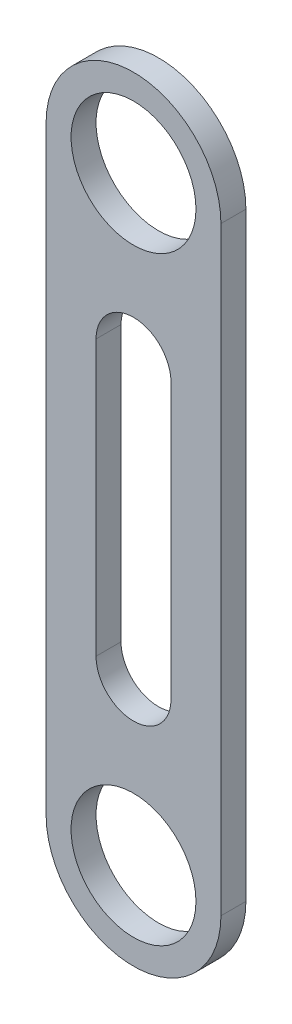
ISO-10303-21;
HEADER;
FILE_DESCRIPTION(('STEP AP214'),'2;1');
FILE_NAME('part.step','',(''),(''),'','','');
FILE_SCHEMA(('AUTOMOTIVE_DESIGN { 1 0 10303 214 1 1 1 1 }'));
ENDSEC;
DATA;
#1=APPLICATION_CONTEXT('core data for automotive mechanical design processes');
#2=APPLICATION_PROTOCOL_DEFINITION('international standard','automotive_design',2000,#1);
#3=PRODUCT_CONTEXT('',#1,'mechanical');
#4=PRODUCT('Part','Part','',(#3));
#5=PRODUCT_RELATED_PRODUCT_CATEGORY('part','',(#4));
#6=PRODUCT_DEFINITION_FORMATION('','',#4);
#7=PRODUCT_DEFINITION_CONTEXT('part definition',#1,'design');
#8=PRODUCT_DEFINITION('design','',#6,#7);
#9=PRODUCT_DEFINITION_SHAPE('','',#8);
#10=(LENGTH_UNIT() NAMED_UNIT(*) SI_UNIT(.MILLI.,.METRE.));
#11=(NAMED_UNIT(*) PLANE_ANGLE_UNIT() SI_UNIT($,.RADIAN.));
#12=(NAMED_UNIT(*) SI_UNIT($,.STERADIAN.) SOLID_ANGLE_UNIT());
#13=UNCERTAINTY_MEASURE_WITH_UNIT(LENGTH_MEASURE(1.E-05),#10,'distance_accuracy_value','');
#14=(GEOMETRIC_REPRESENTATION_CONTEXT(3) GLOBAL_UNCERTAINTY_ASSIGNED_CONTEXT((#13)) GLOBAL_UNIT_ASSIGNED_CONTEXT((#10,
#11,#12)) REPRESENTATION_CONTEXT('',''));
#15=CARTESIAN_POINT('',(0.,0.,0.));
#16=DIRECTION('',(0.,0.,1.));
#17=DIRECTION('',(1.,0.,0.));
#18=AXIS2_PLACEMENT_3D('',#15,#16,#17);
#19=CARTESIAN_POINT('',(4.76250000000001,0.,3.175));
#20=DIRECTION('',(-1.,0.,0.));
#21=DIRECTION('',(0.,-1.,0.));
#22=AXIS2_PLACEMENT_3D('',#19,#20,#21);
#23=PLANE('',#22);
#24=DIRECTION('',(0.,1.,0.));
#25=VECTOR('',#24,1.);
#26=CARTESIAN_POINT('',(4.76250000000001,0.,0.));
#27=LINE('',#26,#25);
#28=CARTESIAN_POINT('',(4.76250000000001,20.6375,0.));
#29=VERTEX_POINT('',#28);
#30=CARTESIAN_POINT('',(4.76250000000001,55.5625,0.));
#31=VERTEX_POINT('',#30);
#32=EDGE_CURVE('E188',#29,#31,#27,.T.);
#33=ORIENTED_EDGE('',*,*,#32,.F.);
#34=DIRECTION('',(0.,0.,-1.));
#35=VECTOR('',#34,1.);
#36=CARTESIAN_POINT('',(4.76250000000001,20.6375,3.175));
#37=LINE('',#36,#35);
#38=CARTESIAN_POINT('',(4.76250000000001,20.6375,3.175));
#39=VERTEX_POINT('',#38);
#40=EDGE_CURVE('E118',#39,#29,#37,.T.);
#41=ORIENTED_EDGE('',*,*,#40,.F.);
#42=DIRECTION('',(0.,1.,0.));
#43=VECTOR('',#42,1.);
#44=CARTESIAN_POINT('',(4.76250000000001,0.,3.175));
#45=LINE('',#44,#43);
#46=CARTESIAN_POINT('',(4.76250000000001,55.5625,3.175));
#47=VERTEX_POINT('',#46);
#48=EDGE_CURVE('E186',#39,#47,#45,.T.);
#49=ORIENTED_EDGE('',*,*,#48,.T.);
#50=DIRECTION('',(0.,0.,-1.));
#51=VECTOR('',#50,1.);
#52=CARTESIAN_POINT('',(4.76250000000001,55.5625,3.175));
#53=LINE('',#52,#51);
#54=EDGE_CURVE('E12',#47,#31,#53,.T.);
#55=ORIENTED_EDGE('',*,*,#54,.T.);
#56=EDGE_LOOP('',(#33,#41,#49,#55));
#57=FACE_BOUND('',#56,.T.);
#58=ADVANCED_FACE('F108',(#57),#23,.T.);
#59=CARTESIAN_POINT('',(0.,20.6375,3.175));
#60=DIRECTION('',(0.,0.,-1.));
#61=DIRECTION('',(-1.,0.,0.));
#62=AXIS2_PLACEMENT_3D('',#59,#60,#61);
#63=CYLINDRICAL_SURFACE('',#62,4.7625);
#64=CARTESIAN_POINT('',(0.,20.6375,0.));
#65=DIRECTION('',(0.,0.,1.));
#66=DIRECTION('',(1.,0.,0.));
#67=AXIS2_PLACEMENT_3D('',#64,#65,#66);
#68=CIRCLE('',#67,4.7625);
#69=CARTESIAN_POINT('',(-4.76249999999999,20.6375,0.));
#70=VERTEX_POINT('',#69);
#71=EDGE_CURVE('E216',#70,#29,#68,.T.);
#72=ORIENTED_EDGE('',*,*,#71,.F.);
#73=DIRECTION('',(0.,0.,-1.));
#74=VECTOR('',#73,1.);
#75=CARTESIAN_POINT('',(-4.76249999999999,20.6375,3.175));
#76=LINE('',#75,#74);
#77=CARTESIAN_POINT('',(-4.76249999999999,20.6375,3.175));
#78=VERTEX_POINT('',#77);
#79=EDGE_CURVE('E154',#78,#70,#76,.T.);
#80=ORIENTED_EDGE('',*,*,#79,.F.);
#81=CARTESIAN_POINT('',(0.,20.6375,3.175));
#82=DIRECTION('',(0.,0.,1.));
#83=DIRECTION('',(1.,0.,0.));
#84=AXIS2_PLACEMENT_3D('',#81,#82,#83);
#85=CIRCLE('',#84,4.7625);
#86=EDGE_CURVE('E196',#78,#39,#85,.T.);
#87=ORIENTED_EDGE('',*,*,#86,.T.);
#88=ORIENTED_EDGE('',*,*,#40,.T.);
#89=EDGE_LOOP('',(#72,#80,#87,#88));
#90=FACE_BOUND('',#89,.T.);
#91=ADVANCED_FACE('F199',(#90),#63,.F.);
#92=CARTESIAN_POINT('',(-4.7625,0.,3.175));
#93=DIRECTION('',(-1.,0.,0.));
#94=DIRECTION('',(0.,-1.,0.));
#95=AXIS2_PLACEMENT_3D('',#92,#93,#94);
#96=PLANE('',#95);
#97=DIRECTION('',(0.,1.,0.));
#98=VECTOR('',#97,1.);
#99=CARTESIAN_POINT('',(-4.7625,0.,0.));
#100=LINE('',#99,#98);
#101=CARTESIAN_POINT('',(-4.76249999999999,55.5625,0.));
#102=VERTEX_POINT('',#101);
#103=EDGE_CURVE('E218',#70,#102,#100,.T.);
#104=ORIENTED_EDGE('',*,*,#103,.T.);
#105=DIRECTION('',(0.,0.,-1.));
#106=VECTOR('',#105,1.);
#107=CARTESIAN_POINT('',(-4.76249999999999,55.5625,3.175));
#108=LINE('',#107,#106);
#109=CARTESIAN_POINT('',(-4.76249999999999,55.5625,3.175));
#110=VERTEX_POINT('',#109);
#111=EDGE_CURVE('E161',#110,#102,#108,.T.);
#112=ORIENTED_EDGE('',*,*,#111,.F.);
#113=DIRECTION('',(0.,1.,0.));
#114=VECTOR('',#113,1.);
#115=CARTESIAN_POINT('',(-4.7625,0.,3.175));
#116=LINE('',#115,#114);
#117=EDGE_CURVE('E127',#78,#110,#116,.T.);
#118=ORIENTED_EDGE('',*,*,#117,.F.);
#119=ORIENTED_EDGE('',*,*,#79,.T.);
#120=EDGE_LOOP('',(#104,#112,#118,#119));
#121=FACE_BOUND('',#120,.T.);
#122=ADVANCED_FACE('F284',(#121),#96,.F.);
#123=CARTESIAN_POINT('',(0.,55.5625,3.175));
#124=DIRECTION('',(0.,0.,-1.));
#125=DIRECTION('',(-1.,0.,0.));
#126=AXIS2_PLACEMENT_3D('',#123,#124,#125);
#127=CYLINDRICAL_SURFACE('',#126,4.7625);
#128=CARTESIAN_POINT('',(0.,55.5625,0.));
#129=DIRECTION('',(0.,0.,1.));
#130=DIRECTION('',(1.,0.,0.));
#131=AXIS2_PLACEMENT_3D('',#128,#129,#130);
#132=CIRCLE('',#131,4.7625);
#133=EDGE_CURVE('E212',#31,#102,#132,.T.);
#134=ORIENTED_EDGE('',*,*,#133,.F.);
#135=ORIENTED_EDGE('',*,*,#54,.F.);
#136=CARTESIAN_POINT('',(0.,55.5625,3.175));
#137=DIRECTION('',(0.,0.,1.));
#138=DIRECTION('',(1.,0.,0.));
#139=AXIS2_PLACEMENT_3D('',#136,#137,#138);
#140=CIRCLE('',#139,4.7625);
#141=EDGE_CURVE('E197',#47,#110,#140,.T.);
#142=ORIENTED_EDGE('',*,*,#141,.T.);
#143=ORIENTED_EDGE('',*,*,#111,.T.);
#144=EDGE_LOOP('',(#134,#135,#142,#143));
#145=FACE_BOUND('',#144,.T.);
#146=ADVANCED_FACE('F288',(#145),#127,.F.);
#147=CARTESIAN_POINT('',(11.1125,0.,3.175));
#148=DIRECTION('',(1.,0.,0.));
#149=DIRECTION('',(0.,1.,0.));
#150=AXIS2_PLACEMENT_3D('',#147,#148,#149);
#151=PLANE('',#150);
#152=DIRECTION('',(0.,-1.,0.));
#153=VECTOR('',#152,1.);
#154=CARTESIAN_POINT('',(11.1125,0.,0.));
#155=LINE('',#154,#153);
#156=CARTESIAN_POINT('',(11.1125,76.2,0.));
#157=VERTEX_POINT('',#156);
#158=CARTESIAN_POINT('',(11.1125,0.,0.));
#159=VERTEX_POINT('',#158);
#160=EDGE_CURVE('E205',#157,#159,#155,.T.);
#161=ORIENTED_EDGE('',*,*,#160,.F.);
#162=DIRECTION('',(0.,0.,-1.));
#163=VECTOR('',#162,1.);
#164=CARTESIAN_POINT('',(11.1125,76.2,3.175));
#165=LINE('',#164,#163);
#166=CARTESIAN_POINT('',(11.1125,76.2,3.175));
#167=VERTEX_POINT('',#166);
#168=EDGE_CURVE('E226',#167,#157,#165,.T.);
#169=ORIENTED_EDGE('',*,*,#168,.F.);
#170=DIRECTION('',(0.,-1.,0.));
#171=VECTOR('',#170,1.);
#172=CARTESIAN_POINT('',(11.1125,0.,3.175));
#173=LINE('',#172,#171);
#174=CARTESIAN_POINT('',(11.1125,0.,3.175));
#175=VERTEX_POINT('',#174);
#176=EDGE_CURVE('E220',#167,#175,#173,.T.);
#177=ORIENTED_EDGE('',*,*,#176,.T.);
#178=DIRECTION('',(0.,0.,-1.));
#179=VECTOR('',#178,1.);
#180=CARTESIAN_POINT('',(11.1125,0.,3.175));
#181=LINE('',#180,#179);
#182=EDGE_CURVE('E168',#175,#159,#181,.T.);
#183=ORIENTED_EDGE('',*,*,#182,.T.);
#184=EDGE_LOOP('',(#161,#169,#177,#183));
#185=FACE_BOUND('',#184,.T.);
#186=ADVANCED_FACE('F266',(#185),#151,.T.);
#187=CARTESIAN_POINT('',(-11.1125,0.,3.175));
#188=DIRECTION('',(1.,0.,0.));
#189=DIRECTION('',(0.,0.,-1.));
#190=AXIS2_PLACEMENT_3D('',#187,#188,#189);
#191=PLANE('',#190);
#192=DIRECTION('',(0.,-1.,0.));
#193=VECTOR('',#192,1.);
#194=CARTESIAN_POINT('',(-11.1125,0.,0.));
#195=LINE('',#194,#193);
#196=CARTESIAN_POINT('',(-11.1125,76.2,0.));
#197=VERTEX_POINT('',#196);
#198=CARTESIAN_POINT('',(-11.1125,0.,0.));
#199=VERTEX_POINT('',#198);
#200=EDGE_CURVE('E208',#197,#199,#195,.T.);
#201=ORIENTED_EDGE('',*,*,#200,.T.);
#202=DIRECTION('',(0.,0.,-1.));
#203=VECTOR('',#202,1.);
#204=CARTESIAN_POINT('',(-11.1125,0.,3.175));
#205=LINE('',#204,#203);
#206=CARTESIAN_POINT('',(-11.1125,0.,3.175));
#207=VERTEX_POINT('',#206);
#208=EDGE_CURVE('E201',#207,#199,#205,.T.);
#209=ORIENTED_EDGE('',*,*,#208,.F.);
#210=DIRECTION('',(0.,-1.,0.));
#211=VECTOR('',#210,1.);
#212=CARTESIAN_POINT('',(-11.1125,0.,3.175));
#213=LINE('',#212,#211);
#214=CARTESIAN_POINT('',(-11.1125,76.2,3.175));
#215=VERTEX_POINT('',#214);
#216=EDGE_CURVE('E261',#215,#207,#213,.T.);
#217=ORIENTED_EDGE('',*,*,#216,.F.);
#218=DIRECTION('',(0.,0.,-1.));
#219=VECTOR('',#218,1.);
#220=CARTESIAN_POINT('',(-11.1125,76.2,3.175));
#221=LINE('',#220,#219);
#222=EDGE_CURVE('E224',#215,#197,#221,.T.);
#223=ORIENTED_EDGE('',*,*,#222,.T.);
#224=EDGE_LOOP('',(#201,#209,#217,#223));
#225=FACE_BOUND('',#224,.T.);
#226=ADVANCED_FACE('F260',(#225),#191,.F.);
#227=CARTESIAN_POINT('',(0.,0.,0.));
#228=DIRECTION('',(0.,0.,1.));
#229=DIRECTION('',(1.,0.,0.));
#230=AXIS2_PLACEMENT_3D('',#227,#228,#229);
#231=PLANE('',#230);
#232=ORIENTED_EDGE('',*,*,#160,.T.);
#233=CARTESIAN_POINT('',(0.,0.,0.));
#234=DIRECTION('',(0.,0.,1.));
#235=DIRECTION('',(1.,0.,0.));
#236=AXIS2_PLACEMENT_3D('',#233,#234,#235);
#237=CIRCLE('',#236,11.1125);
#238=EDGE_CURVE('E232',#199,#159,#237,.T.);
#239=ORIENTED_EDGE('',*,*,#238,.F.);
#240=ORIENTED_EDGE('',*,*,#200,.F.);
#241=CARTESIAN_POINT('',(0.,76.2,0.));
#242=DIRECTION('',(0.,0.,1.));
#243=DIRECTION('',(1.,0.,0.));
#244=AXIS2_PLACEMENT_3D('',#241,#242,#243);
#245=CIRCLE('',#244,11.1125);
#246=EDGE_CURVE('E112',#157,#197,#245,.T.);
#247=ORIENTED_EDGE('',*,*,#246,.F.);
#248=EDGE_LOOP('',(#232,#239,#240,#247));
#249=FACE_BOUND('',#248,.T.);
#250=ORIENTED_EDGE('',*,*,#133,.T.);
#251=ORIENTED_EDGE('',*,*,#103,.F.);
#252=ORIENTED_EDGE('',*,*,#71,.T.);
#253=ORIENTED_EDGE('',*,*,#32,.T.);
#254=EDGE_LOOP('',(#250,#251,#252,#253));
#255=FACE_BOUND('',#254,.T.);
#256=CARTESIAN_POINT('',(0.,76.2,0.));
#257=DIRECTION('',(0.,0.,1.));
#258=DIRECTION('',(1.,0.,0.));
#259=AXIS2_PLACEMENT_3D('',#256,#257,#258);
#260=CIRCLE('',#259,7.9375);
#261=CARTESIAN_POINT('',(7.9375,76.2,0.));
#262=VERTEX_POINT('',#261);
#263=EDGE_CURVE('E242',#262,#262,#260,.T.);
#264=ORIENTED_EDGE('',*,*,#263,.T.);
#265=EDGE_LOOP('',(#264));
#266=FACE_BOUND('',#265,.T.);
#267=CARTESIAN_POINT('',(0.,0.,0.));
#268=DIRECTION('',(0.,0.,1.));
#269=DIRECTION('',(1.,0.,0.));
#270=AXIS2_PLACEMENT_3D('',#267,#268,#269);
#271=CIRCLE('',#270,7.9375);
#272=CARTESIAN_POINT('',(7.9375,0.,0.));
#273=VERTEX_POINT('',#272);
#274=EDGE_CURVE('E233',#273,#273,#271,.T.);
#275=ORIENTED_EDGE('',*,*,#274,.T.);
#276=EDGE_LOOP('',(#275));
#277=FACE_BOUND('',#276,.T.);
#278=ADVANCED_FACE('F257',(#249,#255,#266,#277),#231,.F.);
#279=CARTESIAN_POINT('',(0.,0.,3.175));
#280=DIRECTION('',(0.,0.,1.));
#281=DIRECTION('',(1.,0.,0.));
#282=AXIS2_PLACEMENT_3D('',#279,#280,#281);
#283=PLANE('',#282);
#284=ORIENTED_EDGE('',*,*,#216,.T.);
#285=CARTESIAN_POINT('',(0.,0.,3.175));
#286=DIRECTION('',(0.,0.,1.));
#287=DIRECTION('',(1.,0.,0.));
#288=AXIS2_PLACEMENT_3D('',#285,#286,#287);
#289=CIRCLE('',#288,11.1125);
#290=EDGE_CURVE('E209',#207,#175,#289,.T.);
#291=ORIENTED_EDGE('',*,*,#290,.T.);
#292=ORIENTED_EDGE('',*,*,#176,.F.);
#293=CARTESIAN_POINT('',(0.,76.2,3.175));
#294=DIRECTION('',(0.,0.,1.));
#295=DIRECTION('',(1.,0.,0.));
#296=AXIS2_PLACEMENT_3D('',#293,#294,#295);
#297=CIRCLE('',#296,11.1125);
#298=EDGE_CURVE('E236',#167,#215,#297,.T.);
#299=ORIENTED_EDGE('',*,*,#298,.T.);
#300=EDGE_LOOP('',(#284,#291,#292,#299));
#301=FACE_BOUND('',#300,.T.);
#302=ORIENTED_EDGE('',*,*,#141,.F.);
#303=ORIENTED_EDGE('',*,*,#48,.F.);
#304=ORIENTED_EDGE('',*,*,#86,.F.);
#305=ORIENTED_EDGE('',*,*,#117,.T.);
#306=EDGE_LOOP('',(#302,#303,#304,#305));
#307=FACE_BOUND('',#306,.T.);
#308=CARTESIAN_POINT('',(0.,76.2,3.175));
#309=DIRECTION('',(0.,0.,1.));
#310=DIRECTION('',(1.,0.,0.));
#311=AXIS2_PLACEMENT_3D('',#308,#309,#310);
#312=CIRCLE('',#311,7.9375);
#313=CARTESIAN_POINT('',(7.9375,76.2,3.175));
#314=VERTEX_POINT('',#313);
#315=EDGE_CURVE('E239',#314,#314,#312,.T.);
#316=ORIENTED_EDGE('',*,*,#315,.F.);
#317=EDGE_LOOP('',(#316));
#318=FACE_BOUND('',#317,.T.);
#319=CARTESIAN_POINT('',(0.,0.,3.175));
#320=DIRECTION('',(0.,0.,1.));
#321=DIRECTION('',(1.,0.,0.));
#322=AXIS2_PLACEMENT_3D('',#319,#320,#321);
#323=CIRCLE('',#322,7.9375);
#324=CARTESIAN_POINT('',(7.9375,0.,3.175));
#325=VERTEX_POINT('',#324);
#326=EDGE_CURVE('E229',#325,#325,#323,.T.);
#327=ORIENTED_EDGE('',*,*,#326,.F.);
#328=EDGE_LOOP('',(#327));
#329=FACE_BOUND('',#328,.T.);
#330=ADVANCED_FACE('F194',(#301,#307,#318,#329),#283,.T.);
#331=CARTESIAN_POINT('',(0.,76.2,3.175));
#332=DIRECTION('',(0.,0.,-1.));
#333=DIRECTION('',(-1.,0.,0.));
#334=AXIS2_PLACEMENT_3D('',#331,#332,#333);
#335=CYLINDRICAL_SURFACE('',#334,7.9375);
#336=ORIENTED_EDGE('',*,*,#315,.T.);
#337=EDGE_LOOP('',(#336));
#338=FACE_BOUND('',#337,.T.);
#339=ORIENTED_EDGE('',*,*,#263,.F.);
#340=EDGE_LOOP('',(#339));
#341=FACE_BOUND('',#340,.T.);
#342=ADVANCED_FACE('F271',(#338,#341),#335,.F.);
#343=CARTESIAN_POINT('',(0.,76.2,3.175));
#344=DIRECTION('',(0.,0.,-1.));
#345=DIRECTION('',(-1.,0.,0.));
#346=AXIS2_PLACEMENT_3D('',#343,#344,#345);
#347=CYLINDRICAL_SURFACE('',#346,11.1125);
#348=ORIENTED_EDGE('',*,*,#298,.F.);
#349=ORIENTED_EDGE('',*,*,#168,.T.);
#350=ORIENTED_EDGE('',*,*,#246,.T.);
#351=ORIENTED_EDGE('',*,*,#222,.F.);
#352=EDGE_LOOP('',(#348,#349,#350,#351));
#353=FACE_BOUND('',#352,.T.);
#354=ADVANCED_FACE('F110',(#353),#347,.T.);
#355=CARTESIAN_POINT('',(0.,0.,3.175));
#356=DIRECTION('',(0.,0.,-1.));
#357=DIRECTION('',(-1.,0.,0.));
#358=AXIS2_PLACEMENT_3D('',#355,#356,#357);
#359=CYLINDRICAL_SURFACE('',#358,7.9375);
#360=ORIENTED_EDGE('',*,*,#326,.T.);
#361=EDGE_LOOP('',(#360));
#362=FACE_BOUND('',#361,.T.);
#363=ORIENTED_EDGE('',*,*,#274,.F.);
#364=EDGE_LOOP('',(#363));
#365=FACE_BOUND('',#364,.T.);
#366=ADVANCED_FACE('F269',(#362,#365),#359,.F.);
#367=CARTESIAN_POINT('',(0.,0.,3.175));
#368=DIRECTION('',(0.,0.,-1.));
#369=DIRECTION('',(-1.,0.,0.));
#370=AXIS2_PLACEMENT_3D('',#367,#368,#369);
#371=CYLINDRICAL_SURFACE('',#370,11.1125);
#372=ORIENTED_EDGE('',*,*,#238,.T.);
#373=ORIENTED_EDGE('',*,*,#182,.F.);
#374=ORIENTED_EDGE('',*,*,#290,.F.);
#375=ORIENTED_EDGE('',*,*,#208,.T.);
#376=EDGE_LOOP('',(#372,#373,#374,#375));
#377=FACE_BOUND('',#376,.T.);
#378=ADVANCED_FACE('F267',(#377),#371,.T.);
#379=CLOSED_SHELL('',(#58,#91,#122,#146,#186,#226,#278,#330,#342,#354,#366,#378));
#380=MANIFOLD_SOLID_BREP('B2',#379);
#381=ADVANCED_BREP_SHAPE_REPRESENTATION('',(#18,#380),#14);
#382=SHAPE_DEFINITION_REPRESENTATION(#9,#381);
ENDSEC;
END-ISO-10303-21;
